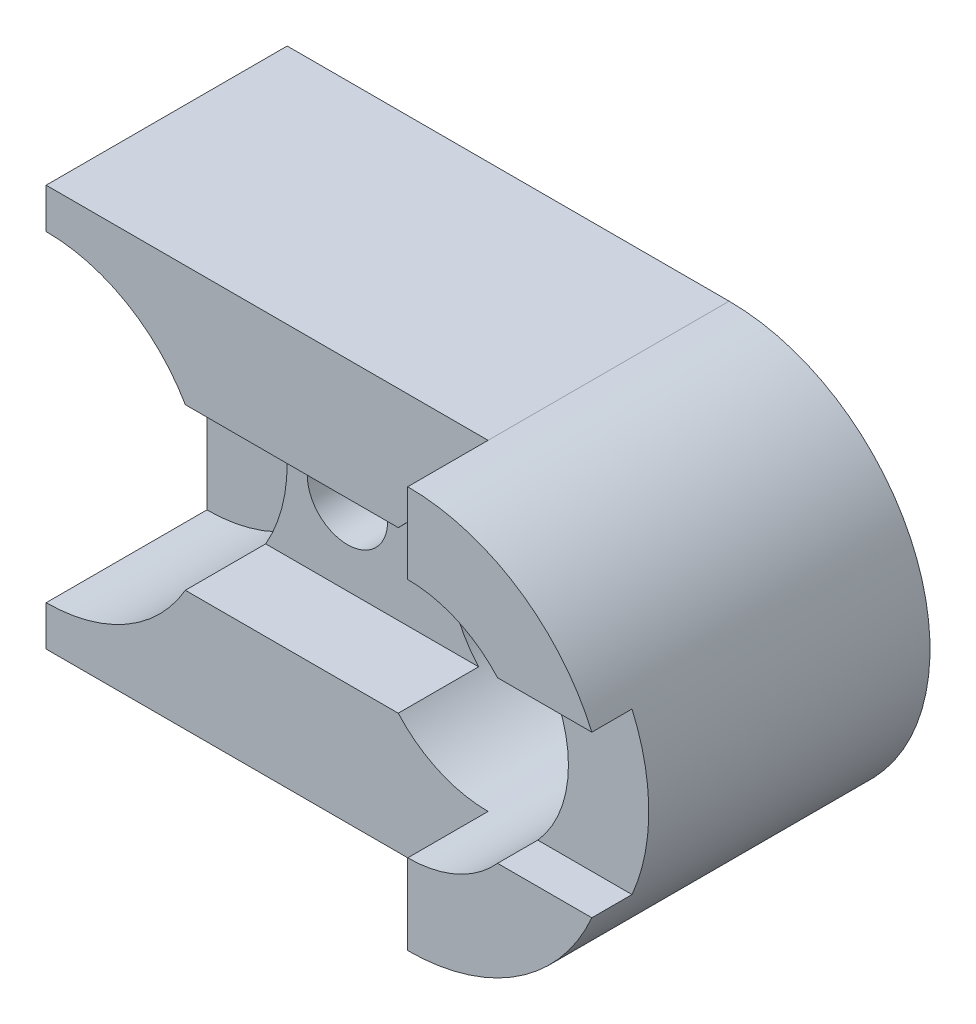
ISO-10303-21;
HEADER;
FILE_DESCRIPTION(('STEP AP214'),'2;1');
FILE_NAME('part.step','',(''),(''),'','','');
FILE_SCHEMA(('AUTOMOTIVE_DESIGN { 1 0 10303 214 1 1 1 1 }'));
ENDSEC;
DATA;
#1=APPLICATION_CONTEXT('core data for automotive mechanical design processes');
#2=APPLICATION_PROTOCOL_DEFINITION('international standard','automotive_design',2000,#1);
#3=PRODUCT_CONTEXT('',#1,'mechanical');
#4=PRODUCT('Part','Part','',(#3));
#5=PRODUCT_RELATED_PRODUCT_CATEGORY('part','',(#4));
#6=PRODUCT_DEFINITION_FORMATION('','',#4);
#7=PRODUCT_DEFINITION_CONTEXT('part definition',#1,'design');
#8=PRODUCT_DEFINITION('design','',#6,#7);
#9=PRODUCT_DEFINITION_SHAPE('','',#8);
#10=(LENGTH_UNIT() NAMED_UNIT(*) SI_UNIT(.MILLI.,.METRE.));
#11=(NAMED_UNIT(*) PLANE_ANGLE_UNIT() SI_UNIT($,.RADIAN.));
#12=(NAMED_UNIT(*) SI_UNIT($,.STERADIAN.) SOLID_ANGLE_UNIT());
#13=UNCERTAINTY_MEASURE_WITH_UNIT(LENGTH_MEASURE(1.E-05),#10,'distance_accuracy_value','');
#14=(GEOMETRIC_REPRESENTATION_CONTEXT(3) GLOBAL_UNCERTAINTY_ASSIGNED_CONTEXT((#13)) GLOBAL_UNIT_ASSIGNED_CONTEXT((#10,
#11,#12)) REPRESENTATION_CONTEXT('',''));
#15=CARTESIAN_POINT('',(0.,0.,0.));
#16=DIRECTION('',(0.,0.,1.));
#17=DIRECTION('',(1.,0.,0.));
#18=AXIS2_PLACEMENT_3D('',#15,#16,#17);
#19=CARTESIAN_POINT('',(-5.5,0.,8.));
#20=DIRECTION('',(0.,0.,-1.));
#21=DIRECTION('',(-1.,0.,0.));
#22=AXIS2_PLACEMENT_3D('',#19,#20,#21);
#23=CYLINDRICAL_SURFACE('',#22,2.);
#24=DIRECTION('',(0.,0.,-1.));
#25=VECTOR('',#24,1.);
#26=CARTESIAN_POINT('',(-5.5,-2.,8.));
#27=LINE('',#26,#25);
#28=CARTESIAN_POINT('',(-5.5,-2.,2.));
#29=VERTEX_POINT('',#28);
#30=CARTESIAN_POINT('',(-5.5,-2.,0.));
#31=VERTEX_POINT('',#30);
#32=EDGE_CURVE('E283',#29,#31,#27,.T.);
#33=ORIENTED_EDGE('',*,*,#32,.F.);
#34=CARTESIAN_POINT('',(-5.5,0.,2.));
#35=DIRECTION('',(0.,0.,1.));
#36=DIRECTION('',(1.,0.,0.));
#37=AXIS2_PLACEMENT_3D('',#34,#35,#36);
#38=CIRCLE('',#37,2.);
#39=CARTESIAN_POINT('',(-5.5,2.,2.));
#40=VERTEX_POINT('',#39);
#41=EDGE_CURVE('E340',#29,#40,#38,.T.);
#42=ORIENTED_EDGE('',*,*,#41,.T.);
#43=DIRECTION('',(0.,0.,-1.));
#44=VECTOR('',#43,1.);
#45=CARTESIAN_POINT('',(-5.5,2.,8.));
#46=LINE('',#45,#44);
#47=CARTESIAN_POINT('',(-5.5,2.,0.));
#48=VERTEX_POINT('',#47);
#49=EDGE_CURVE('E248',#40,#48,#46,.T.);
#50=ORIENTED_EDGE('',*,*,#49,.T.);
#51=CARTESIAN_POINT('',(-5.5,0.,0.));
#52=DIRECTION('',(0.,0.,1.));
#53=DIRECTION('',(1.,0.,0.));
#54=AXIS2_PLACEMENT_3D('',#51,#52,#53);
#55=CIRCLE('',#54,2.);
#56=EDGE_CURVE('E252',#31,#48,#55,.T.);
#57=ORIENTED_EDGE('',*,*,#56,.F.);
#58=EDGE_LOOP('',(#33,#42,#50,#57));
#59=FACE_BOUND('',#58,.T.);
#60=ADVANCED_FACE('F35',(#59),#23,.F.);
#61=CARTESIAN_POINT('',(5.5,0.,8.));
#62=DIRECTION('',(0.,0.,-1.));
#63=DIRECTION('',(-1.,0.,0.));
#64=AXIS2_PLACEMENT_3D('',#61,#62,#63);
#65=CYLINDRICAL_SURFACE('',#64,1.25);
#66=CARTESIAN_POINT('',(5.5,0.,0.));
#67=DIRECTION('',(0.,0.,1.));
#68=DIRECTION('',(1.,0.,0.));
#69=AXIS2_PLACEMENT_3D('',#66,#67,#68);
#70=CIRCLE('',#69,1.25);
#71=CARTESIAN_POINT('',(6.75,0.,0.));
#72=VERTEX_POINT('',#71);
#73=EDGE_CURVE('E268',#72,#72,#70,.T.);
#74=ORIENTED_EDGE('',*,*,#73,.F.);
#75=EDGE_LOOP('',(#74));
#76=FACE_BOUND('',#75,.T.);
#77=CARTESIAN_POINT('',(5.5,0.,3.));
#78=DIRECTION('',(0.,0.,1.));
#79=DIRECTION('',(1.,0.,0.));
#80=AXIS2_PLACEMENT_3D('',#77,#78,#79);
#81=CIRCLE('',#80,1.25);
#82=CARTESIAN_POINT('',(6.75,0.,3.));
#83=VERTEX_POINT('',#82);
#84=EDGE_CURVE('E184',#83,#83,#81,.T.);
#85=ORIENTED_EDGE('',*,*,#84,.T.);
#86=EDGE_LOOP('',(#85));
#87=FACE_BOUND('',#86,.T.);
#88=ADVANCED_FACE('F407',(#76,#87),#65,.F.);
#89=CARTESIAN_POINT('',(0.,0.,6.));
#90=DIRECTION('',(0.,0.,1.));
#91=DIRECTION('',(1.,0.,0.));
#92=AXIS2_PLACEMENT_3D('',#89,#90,#91);
#93=PLANE('',#92);
#94=CARTESIAN_POINT('',(-5.5,0.,6.));
#95=DIRECTION('',(0.,0.,1.));
#96=DIRECTION('',(1.,0.,0.));
#97=AXIS2_PLACEMENT_3D('',#94,#95,#96);
#98=CIRCLE('',#97,4.);
#99=CARTESIAN_POINT('',(-2.03589838486225,2.,6.));
#100=VERTEX_POINT('',#99);
#101=CARTESIAN_POINT('',(-5.5,4.,6.));
#102=VERTEX_POINT('',#101);
#103=EDGE_CURVE('E165',#100,#102,#98,.T.);
#104=ORIENTED_EDGE('',*,*,#103,.F.);
#105=DIRECTION('',(-1.,0.,0.));
#106=VECTOR('',#105,1.);
#107=CARTESIAN_POINT('',(5.5,2.,6.));
#108=LINE('',#107,#106);
#109=CARTESIAN_POINT('',(3.26393202250021,2.,6.));
#110=VERTEX_POINT('',#109);
#111=EDGE_CURVE('E176',#110,#100,#108,.T.);
#112=ORIENTED_EDGE('',*,*,#111,.F.);
#113=CARTESIAN_POINT('',(5.5,0.,6.));
#114=DIRECTION('',(0.,0.,1.));
#115=DIRECTION('',(1.,0.,0.));
#116=AXIS2_PLACEMENT_3D('',#113,#114,#115);
#117=CIRCLE('',#116,3.);
#118=CARTESIAN_POINT('',(5.5,3.,6.));
#119=VERTEX_POINT('',#118);
#120=EDGE_CURVE('E58',#119,#110,#117,.T.);
#121=ORIENTED_EDGE('',*,*,#120,.F.);
#122=DIRECTION('',(0.,-1.,0.));
#123=VECTOR('',#122,1.);
#124=CARTESIAN_POINT('',(5.5,0.,6.));
#125=LINE('',#124,#123);
#126=CARTESIAN_POINT('',(5.5,5.,6.));
#127=VERTEX_POINT('',#126);
#128=EDGE_CURVE('E201',#127,#119,#125,.T.);
#129=ORIENTED_EDGE('',*,*,#128,.F.);
#130=DIRECTION('',(1.,0.,0.));
#131=VECTOR('',#130,1.);
#132=CARTESIAN_POINT('',(0.,5.,6.));
#133=LINE('',#132,#131);
#134=CARTESIAN_POINT('',(-5.5,5.,6.));
#135=VERTEX_POINT('',#134);
#136=EDGE_CURVE('E224',#135,#127,#133,.T.);
#137=ORIENTED_EDGE('',*,*,#136,.F.);
#138=DIRECTION('',(0.,1.,0.));
#139=VECTOR('',#138,1.);
#140=CARTESIAN_POINT('',(-5.5,0.,6.));
#141=LINE('',#140,#139);
#142=EDGE_CURVE('E178',#102,#135,#141,.T.);
#143=ORIENTED_EDGE('',*,*,#142,.F.);
#144=EDGE_LOOP('',(#104,#112,#121,#129,#137,#143));
#145=FACE_BOUND('',#144,.T.);
#146=ADVANCED_FACE('F175',(#145),#93,.T.);
#147=CARTESIAN_POINT('',(-5.5,0.,8.));
#148=DIRECTION('',(-1.,0.,0.));
#149=DIRECTION('',(0.,0.,1.));
#150=AXIS2_PLACEMENT_3D('',#147,#148,#149);
#151=PLANE('',#150);
#152=DIRECTION('',(0.,0.,1.));
#153=VECTOR('',#152,1.);
#154=CARTESIAN_POINT('',(-5.5,-4.,2.));
#155=LINE('',#154,#153);
#156=CARTESIAN_POINT('',(-5.5,-4.,2.));
#157=VERTEX_POINT('',#156);
#158=CARTESIAN_POINT('',(-5.5,-4.,6.));
#159=VERTEX_POINT('',#158);
#160=EDGE_CURVE('E337',#157,#159,#155,.T.);
#161=ORIENTED_EDGE('',*,*,#160,.F.);
#162=DIRECTION('',(0.,1.,0.));
#163=VECTOR('',#162,1.);
#164=CARTESIAN_POINT('',(-5.5,0.,2.));
#165=LINE('',#164,#163);
#166=EDGE_CURVE('E348',#157,#29,#165,.T.);
#167=ORIENTED_EDGE('',*,*,#166,.T.);
#168=ORIENTED_EDGE('',*,*,#32,.T.);
#169=DIRECTION('',(0.,1.,0.));
#170=VECTOR('',#169,1.);
#171=CARTESIAN_POINT('',(-5.5,0.,0.));
#172=LINE('',#171,#170);
#173=CARTESIAN_POINT('',(-5.5,-5.,0.));
#174=VERTEX_POINT('',#173);
#175=EDGE_CURVE('E255',#174,#31,#172,.T.);
#176=ORIENTED_EDGE('',*,*,#175,.F.);
#177=DIRECTION('',(0.,0.,-1.));
#178=VECTOR('',#177,1.);
#179=CARTESIAN_POINT('',(-5.5,-5.,8.));
#180=LINE('',#179,#178);
#181=CARTESIAN_POINT('',(-5.5,-5.,6.));
#182=VERTEX_POINT('',#181);
#183=EDGE_CURVE('E281',#182,#174,#180,.T.);
#184=ORIENTED_EDGE('',*,*,#183,.F.);
#185=DIRECTION('',(0.,1.,0.));
#186=VECTOR('',#185,1.);
#187=CARTESIAN_POINT('',(-5.5,0.,6.));
#188=LINE('',#187,#186);
#189=EDGE_CURVE('E227',#182,#159,#188,.T.);
#190=ORIENTED_EDGE('',*,*,#189,.T.);
#191=EDGE_LOOP('',(#161,#167,#168,#176,#184,#190));
#192=FACE_BOUND('',#191,.T.);
#193=ADVANCED_FACE('F376',(#192),#151,.T.);
#194=CARTESIAN_POINT('',(0.,-5.,8.));
#195=DIRECTION('',(0.,1.,0.));
#196=DIRECTION('',(0.,0.,1.));
#197=AXIS2_PLACEMENT_3D('',#194,#195,#196);
#198=PLANE('',#197);
#199=DIRECTION('',(1.,0.,0.));
#200=VECTOR('',#199,1.);
#201=CARTESIAN_POINT('',(0.,-5.,6.));
#202=LINE('',#201,#200);
#203=CARTESIAN_POINT('',(5.5,-5.,6.));
#204=VERTEX_POINT('',#203);
#205=EDGE_CURVE('E230',#182,#204,#202,.T.);
#206=ORIENTED_EDGE('',*,*,#205,.F.);
#207=ORIENTED_EDGE('',*,*,#183,.T.);
#208=DIRECTION('',(1.,0.,0.));
#209=VECTOR('',#208,1.);
#210=CARTESIAN_POINT('',(0.,-5.,0.));
#211=LINE('',#210,#209);
#212=CARTESIAN_POINT('',(5.5,-5.,0.));
#213=VERTEX_POINT('',#212);
#214=EDGE_CURVE('E258',#174,#213,#211,.T.);
#215=ORIENTED_EDGE('',*,*,#214,.T.);
#216=DIRECTION('',(0.,0.,-1.));
#217=VECTOR('',#216,1.);
#218=CARTESIAN_POINT('',(5.5,-5.,8.));
#219=LINE('',#218,#217);
#220=EDGE_CURVE('E277',#204,#213,#219,.T.);
#221=ORIENTED_EDGE('',*,*,#220,.F.);
#222=EDGE_LOOP('',(#206,#207,#215,#221));
#223=FACE_BOUND('',#222,.T.);
#224=ADVANCED_FACE('F385',(#223),#198,.F.);
#225=CARTESIAN_POINT('',(0.,5.,8.));
#226=DIRECTION('',(0.,1.,0.));
#227=DIRECTION('',(0.,0.,1.));
#228=AXIS2_PLACEMENT_3D('',#225,#226,#227);
#229=PLANE('',#228);
#230=DIRECTION('',(0.,0.,-1.));
#231=VECTOR('',#230,1.);
#232=CARTESIAN_POINT('',(-5.5,5.,8.));
#233=LINE('',#232,#231);
#234=CARTESIAN_POINT('',(-5.5,5.,0.));
#235=VERTEX_POINT('',#234);
#236=EDGE_CURVE('E272',#135,#235,#233,.T.);
#237=ORIENTED_EDGE('',*,*,#236,.F.);
#238=ORIENTED_EDGE('',*,*,#136,.T.);
#239=DIRECTION('',(0.,0.,-1.));
#240=VECTOR('',#239,1.);
#241=CARTESIAN_POINT('',(5.5,5.,8.));
#242=LINE('',#241,#240);
#243=CARTESIAN_POINT('',(5.5,5.,0.));
#244=VERTEX_POINT('',#243);
#245=EDGE_CURVE('E274',#127,#244,#242,.T.);
#246=ORIENTED_EDGE('',*,*,#245,.T.);
#247=DIRECTION('',(1.,0.,0.));
#248=VECTOR('',#247,1.);
#249=CARTESIAN_POINT('',(0.,5.,0.));
#250=LINE('',#249,#248);
#251=EDGE_CURVE('E265',#235,#244,#250,.T.);
#252=ORIENTED_EDGE('',*,*,#251,.F.);
#253=EDGE_LOOP('',(#237,#238,#246,#252));
#254=FACE_BOUND('',#253,.T.);
#255=ADVANCED_FACE('F320',(#254),#229,.T.);
#256=DIRECTION('',(0.,0.,1.));
#257=VECTOR('',#256,1.);
#258=CARTESIAN_POINT('',(-5.5,4.,2.));
#259=LINE('',#258,#257);
#260=CARTESIAN_POINT('',(-5.5,4.,2.));
#261=VERTEX_POINT('',#260);
#262=EDGE_CURVE('E334',#102,#261,#259,.F.);
#263=ORIENTED_EDGE('',*,*,#262,.F.);
#264=ORIENTED_EDGE('',*,*,#142,.T.);
#265=ORIENTED_EDGE('',*,*,#236,.T.);
#266=EDGE_CURVE('E259',#48,#235,#172,.T.);
#267=ORIENTED_EDGE('',*,*,#266,.F.);
#268=ORIENTED_EDGE('',*,*,#49,.F.);
#269=DIRECTION('',(0.,1.,0.));
#270=VECTOR('',#269,1.);
#271=CARTESIAN_POINT('',(-5.5,0.,2.));
#272=LINE('',#271,#270);
#273=EDGE_CURVE('E11',#40,#261,#272,.T.);
#274=ORIENTED_EDGE('',*,*,#273,.T.);
#275=EDGE_LOOP('',(#263,#264,#265,#267,#268,#274));
#276=FACE_BOUND('',#275,.T.);
#277=ADVANCED_FACE('F333',(#276),#151,.T.);
#278=CARTESIAN_POINT('',(0.,0.,8.));
#279=DIRECTION('',(0.,0.,-1.));
#280=DIRECTION('',(-1.,0.,0.));
#281=AXIS2_PLACEMENT_3D('',#278,#279,#280);
#282=CYLINDRICAL_SURFACE('',#281,1.);
#283=CARTESIAN_POINT('',(0.,0.,4.));
#284=DIRECTION('',(0.,0.,-1.));
#285=DIRECTION('',(-1.,0.,0.));
#286=AXIS2_PLACEMENT_3D('',#283,#284,#285);
#287=CIRCLE('',#286,1.);
#288=CARTESIAN_POINT('',(-1.,0.,4.));
#289=VERTEX_POINT('',#288);
#290=EDGE_CURVE('E193',#289,#289,#287,.T.);
#291=ORIENTED_EDGE('',*,*,#290,.F.);
#292=EDGE_LOOP('',(#291));
#293=FACE_BOUND('',#292,.T.);
#294=CARTESIAN_POINT('',(0.,0.,0.));
#295=DIRECTION('',(0.,0.,1.));
#296=DIRECTION('',(1.,0.,0.));
#297=AXIS2_PLACEMENT_3D('',#294,#295,#296);
#298=CIRCLE('',#297,1.);
#299=CARTESIAN_POINT('',(1.,0.,0.));
#300=VERTEX_POINT('',#299);
#301=EDGE_CURVE('E244',#300,#300,#298,.T.);
#302=ORIENTED_EDGE('',*,*,#301,.F.);
#303=EDGE_LOOP('',(#302));
#304=FACE_BOUND('',#303,.T.);
#305=ADVANCED_FACE('F37',(#293,#304),#282,.F.);
#306=CARTESIAN_POINT('',(0.,0.,8.));
#307=DIRECTION('',(0.,0.,1.));
#308=DIRECTION('',(1.,0.,0.));
#309=AXIS2_PLACEMENT_3D('',#306,#307,#308);
#310=PLANE('',#309);
#311=CARTESIAN_POINT('',(5.5,0.,8.));
#312=DIRECTION('',(0.,0.,1.));
#313=DIRECTION('',(1.,0.,0.));
#314=AXIS2_PLACEMENT_3D('',#311,#312,#313);
#315=CIRCLE('',#314,5.);
#316=CARTESIAN_POINT('',(5.5,5.,8.));
#317=VERTEX_POINT('',#316);
#318=CARTESIAN_POINT('',(10.0825756949558,2.,8.));
#319=VERTEX_POINT('',#318);
#320=EDGE_CURVE('E245',#317,#319,#315,.F.);
#321=ORIENTED_EDGE('',*,*,#320,.F.);
#322=DIRECTION('',(0.,-1.,0.));
#323=VECTOR('',#322,1.);
#324=CARTESIAN_POINT('',(5.5,0.,8.));
#325=LINE('',#324,#323);
#326=CARTESIAN_POINT('',(5.5,3.,8.));
#327=VERTEX_POINT('',#326);
#328=EDGE_CURVE('E202',#317,#327,#325,.T.);
#329=ORIENTED_EDGE('',*,*,#328,.T.);
#330=CARTESIAN_POINT('',(5.5,0.,8.));
#331=DIRECTION('',(0.,0.,1.));
#332=DIRECTION('',(1.,0.,0.));
#333=AXIS2_PLACEMENT_3D('',#330,#331,#332);
#334=CIRCLE('',#333,3.);
#335=CARTESIAN_POINT('',(7.73606797749979,2.,8.));
#336=VERTEX_POINT('',#335);
#337=EDGE_CURVE('E208',#336,#327,#334,.T.);
#338=ORIENTED_EDGE('',*,*,#337,.F.);
#339=DIRECTION('',(-1.,0.,0.));
#340=VECTOR('',#339,1.);
#341=CARTESIAN_POINT('',(0.,2.,8.));
#342=LINE('',#341,#340);
#343=EDGE_CURVE('E285',#319,#336,#342,.T.);
#344=ORIENTED_EDGE('',*,*,#343,.F.);
#345=EDGE_LOOP('',(#321,#329,#338,#344));
#346=FACE_BOUND('',#345,.T.);
#347=ADVANCED_FACE('F311',(#346),#310,.T.);
#348=CARTESIAN_POINT('',(5.50000000000004,-3.,8.));
#349=VERTEX_POINT('',#348);
#350=CARTESIAN_POINT('',(7.73606797749979,-2.,8.));
#351=VERTEX_POINT('',#350);
#352=EDGE_CURVE('E209',#349,#351,#334,.T.);
#353=ORIENTED_EDGE('',*,*,#352,.F.);
#354=DIRECTION('',(0.,-1.,0.));
#355=VECTOR('',#354,1.);
#356=CARTESIAN_POINT('',(5.50000000000002,0.,8.));
#357=LINE('',#356,#355);
#358=CARTESIAN_POINT('',(5.5,-5.,8.));
#359=VERTEX_POINT('',#358);
#360=EDGE_CURVE('E196',#349,#359,#357,.T.);
#361=ORIENTED_EDGE('',*,*,#360,.T.);
#362=CARTESIAN_POINT('',(10.0825756949558,-2.,8.));
#363=VERTEX_POINT('',#362);
#364=EDGE_CURVE('E249',#363,#359,#315,.F.);
#365=ORIENTED_EDGE('',*,*,#364,.F.);
#366=DIRECTION('',(1.,0.,0.));
#367=VECTOR('',#366,1.);
#368=CARTESIAN_POINT('',(0.,-2.,8.));
#369=LINE('',#368,#367);
#370=EDGE_CURVE('E288',#351,#363,#369,.T.);
#371=ORIENTED_EDGE('',*,*,#370,.F.);
#372=EDGE_LOOP('',(#353,#361,#365,#371));
#373=FACE_BOUND('',#372,.T.);
#374=ADVANCED_FACE('F392',(#373),#310,.T.);
#375=CARTESIAN_POINT('',(5.5,0.,8.));
#376=DIRECTION('',(0.,0.,-1.));
#377=DIRECTION('',(-1.,0.,0.));
#378=AXIS2_PLACEMENT_3D('',#375,#376,#377);
#379=CYLINDRICAL_SURFACE('',#378,5.);
#380=DIRECTION('',(0.,0.,-1.));
#381=VECTOR('',#380,1.);
#382=CARTESIAN_POINT('',(10.0825756949558,-2.,8.));
#383=LINE('',#382,#381);
#384=CARTESIAN_POINT('',(10.0825756949558,-2.,7.));
#385=VERTEX_POINT('',#384);
#386=EDGE_CURVE('E240',#363,#385,#383,.T.);
#387=ORIENTED_EDGE('',*,*,#386,.F.);
#388=ORIENTED_EDGE('',*,*,#364,.T.);
#389=EDGE_CURVE('E278',#359,#204,#219,.T.);
#390=ORIENTED_EDGE('',*,*,#389,.T.);
#391=ORIENTED_EDGE('',*,*,#220,.T.);
#392=CARTESIAN_POINT('',(5.5,0.,0.));
#393=DIRECTION('',(0.,0.,1.));
#394=DIRECTION('',(1.,0.,0.));
#395=AXIS2_PLACEMENT_3D('',#392,#393,#394);
#396=CIRCLE('',#395,5.);
#397=EDGE_CURVE('E262',#244,#213,#396,.F.);
#398=ORIENTED_EDGE('',*,*,#397,.F.);
#399=ORIENTED_EDGE('',*,*,#245,.F.);
#400=EDGE_CURVE('E275',#317,#127,#242,.T.);
#401=ORIENTED_EDGE('',*,*,#400,.F.);
#402=ORIENTED_EDGE('',*,*,#320,.T.);
#403=DIRECTION('',(0.,0.,-1.));
#404=VECTOR('',#403,1.);
#405=CARTESIAN_POINT('',(10.0825756949558,2.,8.));
#406=LINE('',#405,#404);
#407=CARTESIAN_POINT('',(10.0825756949558,2.,7.));
#408=VERTEX_POINT('',#407);
#409=EDGE_CURVE('E236',#408,#319,#406,.F.);
#410=ORIENTED_EDGE('',*,*,#409,.F.);
#411=CARTESIAN_POINT('',(5.5,0.,7.));
#412=DIRECTION('',(0.,0.,-1.));
#413=DIRECTION('',(0.,1.,0.));
#414=AXIS2_PLACEMENT_3D('',#411,#412,#413);
#415=CIRCLE('',#414,5.);
#416=EDGE_CURVE('E242',#385,#408,#415,.F.);
#417=ORIENTED_EDGE('',*,*,#416,.F.);
#418=EDGE_LOOP('',(#387,#388,#390,#391,#398,#399,#401,#402,#410,#417));
#419=FACE_BOUND('',#418,.T.);
#420=ADVANCED_FACE('F305',(#419),#379,.T.);
#421=CARTESIAN_POINT('',(0.,0.,0.));
#422=DIRECTION('',(0.,0.,1.));
#423=DIRECTION('',(1.,0.,0.));
#424=AXIS2_PLACEMENT_3D('',#421,#422,#423);
#425=PLANE('',#424);
#426=ORIENTED_EDGE('',*,*,#301,.T.);
#427=EDGE_LOOP('',(#426));
#428=FACE_BOUND('',#427,.T.);
#429=ORIENTED_EDGE('',*,*,#56,.T.);
#430=ORIENTED_EDGE('',*,*,#266,.T.);
#431=ORIENTED_EDGE('',*,*,#251,.T.);
#432=ORIENTED_EDGE('',*,*,#397,.T.);
#433=ORIENTED_EDGE('',*,*,#214,.F.);
#434=ORIENTED_EDGE('',*,*,#175,.T.);
#435=EDGE_LOOP('',(#429,#430,#431,#432,#433,#434));
#436=FACE_BOUND('',#435,.T.);
#437=ORIENTED_EDGE('',*,*,#73,.T.);
#438=EDGE_LOOP('',(#437));
#439=FACE_BOUND('',#438,.T.);
#440=ADVANCED_FACE('F327',(#428,#436,#439),#425,.F.);
#441=CARTESIAN_POINT('',(12.5,-2.,8.));
#442=DIRECTION('',(0.,-1.,0.));
#443=DIRECTION('',(0.,0.,-1.));
#444=AXIS2_PLACEMENT_3D('',#441,#442,#443);
#445=PLANE('',#444);
#446=DIRECTION('',(-1.,0.,0.));
#447=VECTOR('',#446,1.);
#448=CARTESIAN_POINT('',(12.5,-2.,7.));
#449=LINE('',#448,#447);
#450=CARTESIAN_POINT('',(7.73606797749979,-2.,7.));
#451=VERTEX_POINT('',#450);
#452=EDGE_CURVE('E233',#385,#451,#449,.T.);
#453=ORIENTED_EDGE('',*,*,#452,.T.);
#454=DIRECTION('',(0.,0.,1.));
#455=VECTOR('',#454,1.);
#456=CARTESIAN_POINT('',(7.73606797749979,-2.,6.));
#457=LINE('',#456,#455);
#458=EDGE_CURVE('E220',#451,#351,#457,.T.);
#459=ORIENTED_EDGE('',*,*,#458,.T.);
#460=ORIENTED_EDGE('',*,*,#370,.T.);
#461=ORIENTED_EDGE('',*,*,#386,.T.);
#462=EDGE_LOOP('',(#453,#459,#460,#461));
#463=FACE_BOUND('',#462,.T.);
#464=ADVANCED_FACE('F395',(#463),#445,.F.);
#465=CARTESIAN_POINT('',(12.5,2.,7.));
#466=DIRECTION('',(0.,0.,-1.));
#467=DIRECTION('',(0.,1.,0.));
#468=AXIS2_PLACEMENT_3D('',#465,#466,#467);
#469=PLANE('',#468);
#470=DIRECTION('',(-1.,0.,0.));
#471=VECTOR('',#470,1.);
#472=CARTESIAN_POINT('',(12.5,2.,7.));
#473=LINE('',#472,#471);
#474=CARTESIAN_POINT('',(7.73606797749979,2.,7.));
#475=VERTEX_POINT('',#474);
#476=EDGE_CURVE('E232',#408,#475,#473,.T.);
#477=ORIENTED_EDGE('',*,*,#476,.T.);
#478=CARTESIAN_POINT('',(5.5,0.,7.));
#479=DIRECTION('',(0.,0.,-1.));
#480=DIRECTION('',(0.,1.,0.));
#481=AXIS2_PLACEMENT_3D('',#478,#479,#480);
#482=CIRCLE('',#481,3.);
#483=EDGE_CURVE('E216',#475,#451,#482,.T.);
#484=ORIENTED_EDGE('',*,*,#483,.T.);
#485=ORIENTED_EDGE('',*,*,#452,.F.);
#486=ORIENTED_EDGE('',*,*,#416,.T.);
#487=EDGE_LOOP('',(#477,#484,#485,#486));
#488=FACE_BOUND('',#487,.T.);
#489=ADVANCED_FACE('F300',(#488),#469,.F.);
#490=CARTESIAN_POINT('',(12.5,2.,8.));
#491=DIRECTION('',(0.,1.,0.));
#492=DIRECTION('',(0.,0.,1.));
#493=AXIS2_PLACEMENT_3D('',#490,#491,#492);
#494=PLANE('',#493);
#495=ORIENTED_EDGE('',*,*,#343,.T.);
#496=DIRECTION('',(0.,0.,1.));
#497=VECTOR('',#496,1.);
#498=CARTESIAN_POINT('',(7.73606797749979,2.,6.));
#499=LINE('',#498,#497);
#500=EDGE_CURVE('E290',#336,#475,#499,.F.);
#501=ORIENTED_EDGE('',*,*,#500,.T.);
#502=ORIENTED_EDGE('',*,*,#476,.F.);
#503=ORIENTED_EDGE('',*,*,#409,.T.);
#504=EDGE_LOOP('',(#495,#501,#502,#503));
#505=FACE_BOUND('',#504,.T.);
#506=ADVANCED_FACE('F295',(#505),#494,.F.);
#507=CARTESIAN_POINT('',(-2.03589838486225,-2.,6.));
#508=VERTEX_POINT('',#507);
#509=EDGE_CURVE('E180',#159,#508,#98,.T.);
#510=ORIENTED_EDGE('',*,*,#509,.F.);
#511=ORIENTED_EDGE('',*,*,#189,.F.);
#512=ORIENTED_EDGE('',*,*,#205,.T.);
#513=DIRECTION('',(0.,-1.,0.));
#514=VECTOR('',#513,1.);
#515=CARTESIAN_POINT('',(5.50000000000002,0.,6.));
#516=LINE('',#515,#514);
#517=CARTESIAN_POINT('',(5.50000000000004,-3.,6.));
#518=VERTEX_POINT('',#517);
#519=EDGE_CURVE('E198',#518,#204,#516,.T.);
#520=ORIENTED_EDGE('',*,*,#519,.F.);
#521=CARTESIAN_POINT('',(3.26393202250021,-2.,6.));
#522=VERTEX_POINT('',#521);
#523=EDGE_CURVE('E351',#522,#518,#117,.T.);
#524=ORIENTED_EDGE('',*,*,#523,.F.);
#525=DIRECTION('',(-1.,0.,0.));
#526=VECTOR('',#525,1.);
#527=CARTESIAN_POINT('',(5.5,-2.,6.));
#528=LINE('',#527,#526);
#529=EDGE_CURVE('E197',#522,#508,#528,.T.);
#530=ORIENTED_EDGE('',*,*,#529,.T.);
#531=EDGE_LOOP('',(#510,#511,#512,#520,#524,#530));
#532=FACE_BOUND('',#531,.T.);
#533=ADVANCED_FACE('F382',(#532),#93,.T.);
#534=CARTESIAN_POINT('',(5.5,0.,6.));
#535=DIRECTION('',(0.,0.,1.));
#536=DIRECTION('',(1.,0.,0.));
#537=AXIS2_PLACEMENT_3D('',#534,#535,#536);
#538=CYLINDRICAL_SURFACE('',#537,3.);
#539=ORIENTED_EDGE('',*,*,#483,.F.);
#540=ORIENTED_EDGE('',*,*,#500,.F.);
#541=ORIENTED_EDGE('',*,*,#337,.T.);
#542=DIRECTION('',(0.,0.,1.));
#543=VECTOR('',#542,1.);
#544=CARTESIAN_POINT('',(5.5,3.,6.));
#545=LINE('',#544,#543);
#546=EDGE_CURVE('E213',#119,#327,#545,.T.);
#547=ORIENTED_EDGE('',*,*,#546,.F.);
#548=ORIENTED_EDGE('',*,*,#120,.T.);
#549=DIRECTION('',(0.,0.,1.));
#550=VECTOR('',#549,1.);
#551=CARTESIAN_POINT('',(3.26393202250021,2.,3.));
#552=LINE('',#551,#550);
#553=CARTESIAN_POINT('',(3.26393202250021,2.,4.));
#554=VERTEX_POINT('',#553);
#555=EDGE_CURVE('E171',#554,#110,#552,.T.);
#556=ORIENTED_EDGE('',*,*,#555,.F.);
#557=CARTESIAN_POINT('',(5.5,0.,4.));
#558=DIRECTION('',(0.,0.,-1.));
#559=DIRECTION('',(-1.,0.,0.));
#560=AXIS2_PLACEMENT_3D('',#557,#558,#559);
#561=CIRCLE('',#560,3.);
#562=CARTESIAN_POINT('',(3.26393202250021,-2.,4.));
#563=VERTEX_POINT('',#562);
#564=EDGE_CURVE('E355',#563,#554,#561,.T.);
#565=ORIENTED_EDGE('',*,*,#564,.F.);
#566=DIRECTION('',(0.,0.,1.));
#567=VECTOR('',#566,1.);
#568=CARTESIAN_POINT('',(3.26393202250021,-2.,3.));
#569=LINE('',#568,#567);
#570=EDGE_CURVE('E189',#522,#563,#569,.F.);
#571=ORIENTED_EDGE('',*,*,#570,.F.);
#572=ORIENTED_EDGE('',*,*,#523,.T.);
#573=DIRECTION('',(0.,0.,1.));
#574=VECTOR('',#573,1.);
#575=CARTESIAN_POINT('',(5.50000000000004,-3.,6.));
#576=LINE('',#575,#574);
#577=EDGE_CURVE('E205',#518,#349,#576,.T.);
#578=ORIENTED_EDGE('',*,*,#577,.T.);
#579=ORIENTED_EDGE('',*,*,#352,.T.);
#580=ORIENTED_EDGE('',*,*,#458,.F.);
#581=EDGE_LOOP('',(#539,#540,#541,#547,#548,#556,#565,#571,#572,#578,#579,#580));
#582=FACE_BOUND('',#581,.T.);
#583=CARTESIAN_POINT('',(5.5,0.,3.));
#584=DIRECTION('',(0.,0.,1.));
#585=DIRECTION('',(1.,0.,0.));
#586=AXIS2_PLACEMENT_3D('',#583,#584,#585);
#587=CIRCLE('',#586,3.);
#588=CARTESIAN_POINT('',(8.5,0.,3.));
#589=VERTEX_POINT('',#588);
#590=EDGE_CURVE('E352',#589,#589,#587,.T.);
#591=ORIENTED_EDGE('',*,*,#590,.F.);
#592=EDGE_LOOP('',(#591));
#593=FACE_BOUND('',#592,.T.);
#594=ADVANCED_FACE('F312',(#582,#593),#538,.F.);
#595=CARTESIAN_POINT('',(5.5,0.,6.));
#596=DIRECTION('',(-1.,0.,0.));
#597=DIRECTION('',(0.,-1.,0.));
#598=AXIS2_PLACEMENT_3D('',#595,#596,#597);
#599=PLANE('',#598);
#600=ORIENTED_EDGE('',*,*,#128,.T.);
#601=ORIENTED_EDGE('',*,*,#546,.T.);
#602=ORIENTED_EDGE('',*,*,#328,.F.);
#603=ORIENTED_EDGE('',*,*,#400,.T.);
#604=EDGE_LOOP('',(#600,#601,#602,#603));
#605=FACE_BOUND('',#604,.T.);
#606=ADVANCED_FACE('F315',(#605),#599,.T.);
#607=CARTESIAN_POINT('',(5.50000000000002,0.,6.));
#608=DIRECTION('',(-1.,0.,0.));
#609=DIRECTION('',(0.,-1.,0.));
#610=AXIS2_PLACEMENT_3D('',#607,#608,#609);
#611=PLANE('',#610);
#612=ORIENTED_EDGE('',*,*,#360,.F.);
#613=ORIENTED_EDGE('',*,*,#577,.F.);
#614=ORIENTED_EDGE('',*,*,#519,.T.);
#615=ORIENTED_EDGE('',*,*,#389,.F.);
#616=EDGE_LOOP('',(#612,#613,#614,#615));
#617=FACE_BOUND('',#616,.T.);
#618=ADVANCED_FACE('F388',(#617),#611,.T.);
#619=CARTESIAN_POINT('',(5.5,-2.,6.));
#620=DIRECTION('',(0.,-1.,0.));
#621=DIRECTION('',(0.,0.,-1.));
#622=AXIS2_PLACEMENT_3D('',#619,#620,#621);
#623=PLANE('',#622);
#624=DIRECTION('',(-1.,0.,0.));
#625=VECTOR('',#624,1.);
#626=CARTESIAN_POINT('',(5.5,-2.,4.));
#627=LINE('',#626,#625);
#628=CARTESIAN_POINT('',(-2.03589838486225,-2.,4.));
#629=VERTEX_POINT('',#628);
#630=EDGE_CURVE('E186',#563,#629,#627,.T.);
#631=ORIENTED_EDGE('',*,*,#630,.T.);
#632=DIRECTION('',(0.,0.,1.));
#633=VECTOR('',#632,1.);
#634=CARTESIAN_POINT('',(-2.03589838486225,-2.,2.));
#635=LINE('',#634,#633);
#636=EDGE_CURVE('E338',#629,#508,#635,.T.);
#637=ORIENTED_EDGE('',*,*,#636,.T.);
#638=ORIENTED_EDGE('',*,*,#529,.F.);
#639=ORIENTED_EDGE('',*,*,#570,.T.);
#640=EDGE_LOOP('',(#631,#637,#638,#639));
#641=FACE_BOUND('',#640,.T.);
#642=ADVANCED_FACE('F365',(#641),#623,.F.);
#643=CARTESIAN_POINT('',(5.5,2.,4.));
#644=DIRECTION('',(0.,0.,-1.));
#645=DIRECTION('',(-1.,0.,0.));
#646=AXIS2_PLACEMENT_3D('',#643,#644,#645);
#647=PLANE('',#646);
#648=DIRECTION('',(-1.,0.,0.));
#649=VECTOR('',#648,1.);
#650=CARTESIAN_POINT('',(5.5,2.,4.));
#651=LINE('',#650,#649);
#652=CARTESIAN_POINT('',(-2.03589838486225,2.,4.));
#653=VERTEX_POINT('',#652);
#654=EDGE_CURVE('E183',#554,#653,#651,.T.);
#655=ORIENTED_EDGE('',*,*,#654,.T.);
#656=CARTESIAN_POINT('',(-5.5,0.,4.));
#657=DIRECTION('',(0.,0.,-1.));
#658=DIRECTION('',(-1.,0.,0.));
#659=AXIS2_PLACEMENT_3D('',#656,#657,#658);
#660=CIRCLE('',#659,4.);
#661=EDGE_CURVE('E50',#653,#629,#660,.T.);
#662=ORIENTED_EDGE('',*,*,#661,.T.);
#663=ORIENTED_EDGE('',*,*,#630,.F.);
#664=ORIENTED_EDGE('',*,*,#564,.T.);
#665=EDGE_LOOP('',(#655,#662,#663,#664));
#666=FACE_BOUND('',#665,.T.);
#667=ORIENTED_EDGE('',*,*,#290,.T.);
#668=EDGE_LOOP('',(#667));
#669=FACE_BOUND('',#668,.T.);
#670=ADVANCED_FACE('F368',(#666,#669),#647,.F.);
#671=CARTESIAN_POINT('',(5.5,2.,6.));
#672=DIRECTION('',(0.,1.,0.));
#673=DIRECTION('',(0.,0.,1.));
#674=AXIS2_PLACEMENT_3D('',#671,#672,#673);
#675=PLANE('',#674);
#676=ORIENTED_EDGE('',*,*,#111,.T.);
#677=DIRECTION('',(0.,0.,1.));
#678=VECTOR('',#677,1.);
#679=CARTESIAN_POINT('',(-2.03589838486225,2.,2.));
#680=LINE('',#679,#678);
#681=EDGE_CURVE('E43',#100,#653,#680,.F.);
#682=ORIENTED_EDGE('',*,*,#681,.T.);
#683=ORIENTED_EDGE('',*,*,#654,.F.);
#684=ORIENTED_EDGE('',*,*,#555,.T.);
#685=EDGE_LOOP('',(#676,#682,#683,#684));
#686=FACE_BOUND('',#685,.T.);
#687=ADVANCED_FACE('F182',(#686),#675,.F.);
#688=CARTESIAN_POINT('',(5.5,0.,3.));
#689=DIRECTION('',(0.,0.,1.));
#690=DIRECTION('',(1.,0.,0.));
#691=AXIS2_PLACEMENT_3D('',#688,#689,#690);
#692=PLANE('',#691);
#693=ORIENTED_EDGE('',*,*,#84,.F.);
#694=EDGE_LOOP('',(#693));
#695=FACE_BOUND('',#694,.T.);
#696=ORIENTED_EDGE('',*,*,#590,.T.);
#697=EDGE_LOOP('',(#696));
#698=FACE_BOUND('',#697,.T.);
#699=ADVANCED_FACE('F546',(#695,#698),#692,.T.);
#700=CARTESIAN_POINT('',(-5.5,0.,2.));
#701=DIRECTION('',(0.,0.,1.));
#702=DIRECTION('',(1.,0.,0.));
#703=AXIS2_PLACEMENT_3D('',#700,#701,#702);
#704=CYLINDRICAL_SURFACE('',#703,4.);
#705=ORIENTED_EDGE('',*,*,#160,.T.);
#706=ORIENTED_EDGE('',*,*,#509,.T.);
#707=ORIENTED_EDGE('',*,*,#636,.F.);
#708=ORIENTED_EDGE('',*,*,#661,.F.);
#709=ORIENTED_EDGE('',*,*,#681,.F.);
#710=ORIENTED_EDGE('',*,*,#103,.T.);
#711=ORIENTED_EDGE('',*,*,#262,.T.);
#712=CARTESIAN_POINT('',(-5.5,0.,2.));
#713=DIRECTION('',(0.,0.,1.));
#714=DIRECTION('',(1.,0.,0.));
#715=AXIS2_PLACEMENT_3D('',#712,#713,#714);
#716=CIRCLE('',#715,4.);
#717=EDGE_CURVE('E179',#157,#261,#716,.T.);
#718=ORIENTED_EDGE('',*,*,#717,.F.);
#719=EDGE_LOOP('',(#705,#706,#707,#708,#709,#710,#711,#718));
#720=FACE_BOUND('',#719,.T.);
#721=ADVANCED_FACE('F164',(#720),#704,.F.);
#722=CARTESIAN_POINT('',(-5.5,0.,2.));
#723=DIRECTION('',(0.,0.,1.));
#724=DIRECTION('',(1.,0.,0.));
#725=AXIS2_PLACEMENT_3D('',#722,#723,#724);
#726=PLANE('',#725);
#727=ORIENTED_EDGE('',*,*,#717,.T.);
#728=ORIENTED_EDGE('',*,*,#273,.F.);
#729=ORIENTED_EDGE('',*,*,#41,.F.);
#730=ORIENTED_EDGE('',*,*,#166,.F.);
#731=EDGE_LOOP('',(#727,#728,#729,#730));
#732=FACE_BOUND('',#731,.T.);
#733=ADVANCED_FACE('F372',(#732),#726,.T.);
#734=CLOSED_SHELL('',(#60,#88,#146,#193,#224,#255,#277,#305,#347,#374,#420,#440,#464,#489,#506,
#533,#594,#606,#618,#642,#670,#687,#699,#721,#733));
#735=MANIFOLD_SOLID_BREP('B2',#734);
#736=ADVANCED_BREP_SHAPE_REPRESENTATION('',(#18,#735),#14);
#737=SHAPE_DEFINITION_REPRESENTATION(#9,#736);
ENDSEC;
END-ISO-10303-21;
